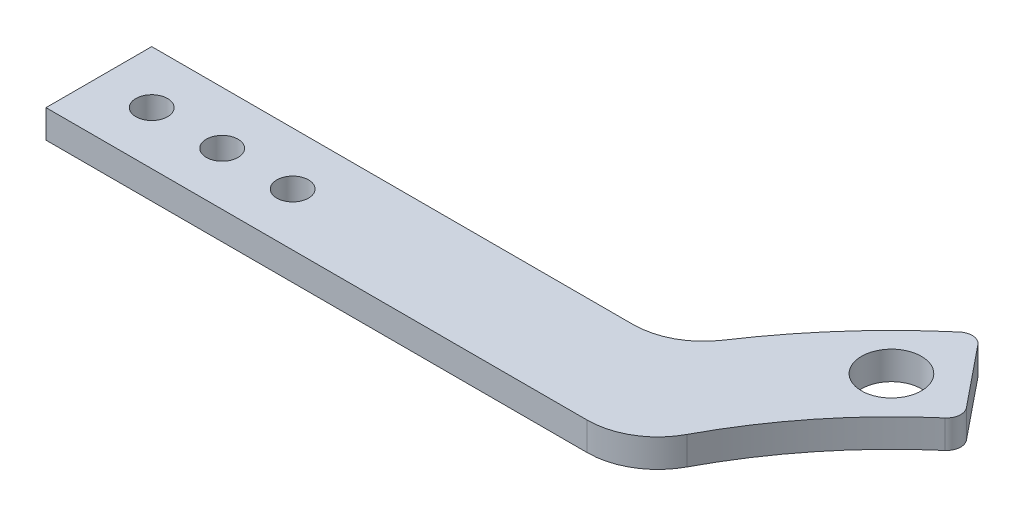
ISO-10303-21;
HEADER;
FILE_DESCRIPTION(('STEP AP214'),'2;1');
FILE_NAME('part.step','',(''),(''),'','','');
FILE_SCHEMA(('AUTOMOTIVE_DESIGN { 1 0 10303 214 1 1 1 1 }'));
ENDSEC;
DATA;
#1=APPLICATION_CONTEXT('core data for automotive mechanical design processes');
#2=APPLICATION_PROTOCOL_DEFINITION('international standard','automotive_design',2000,#1);
#3=PRODUCT_CONTEXT('',#1,'mechanical');
#4=PRODUCT('Part','Part','',(#3));
#5=PRODUCT_RELATED_PRODUCT_CATEGORY('part','',(#4));
#6=PRODUCT_DEFINITION_FORMATION('','',#4);
#7=PRODUCT_DEFINITION_CONTEXT('part definition',#1,'design');
#8=PRODUCT_DEFINITION('design','',#6,#7);
#9=PRODUCT_DEFINITION_SHAPE('','',#8);
#10=(LENGTH_UNIT() NAMED_UNIT(*) SI_UNIT(.MILLI.,.METRE.));
#11=(NAMED_UNIT(*) PLANE_ANGLE_UNIT() SI_UNIT($,.RADIAN.));
#12=(NAMED_UNIT(*) SI_UNIT($,.STERADIAN.) SOLID_ANGLE_UNIT());
#13=UNCERTAINTY_MEASURE_WITH_UNIT(LENGTH_MEASURE(1.E-05),#10,'distance_accuracy_value','');
#14=(GEOMETRIC_REPRESENTATION_CONTEXT(3) GLOBAL_UNCERTAINTY_ASSIGNED_CONTEXT((#13)) GLOBAL_UNIT_ASSIGNED_CONTEXT((#10,
#11,#12)) REPRESENTATION_CONTEXT('',''));
#15=CARTESIAN_POINT('',(0.,0.,0.));
#16=DIRECTION('',(0.,0.,1.));
#17=DIRECTION('',(1.,0.,0.));
#18=AXIS2_PLACEMENT_3D('',#15,#16,#17);
#19=CARTESIAN_POINT('',(-119.959666924148,0.,-35.));
#20=DIRECTION('',(0.,1.,0.));
#21=DIRECTION('',(0.,0.,1.));
#22=AXIS2_PLACEMENT_3D('',#19,#20,#21);
#23=CYLINDRICAL_SURFACE('',#22,2.25000000000001);
#24=CARTESIAN_POINT('',(-119.959666924148,0.,-35.));
#25=DIRECTION('',(0.,1.,0.));
#26=DIRECTION('',(0.,0.,1.));
#27=AXIS2_PLACEMENT_3D('',#24,#25,#26);
#28=CIRCLE('',#27,2.25000000000001);
#29=CARTESIAN_POINT('',(-119.959666924148,0.,-32.75));
#30=VERTEX_POINT('',#29);
#31=EDGE_CURVE('E156',#30,#30,#28,.T.);
#32=ORIENTED_EDGE('',*,*,#31,.F.);
#33=EDGE_LOOP('',(#32));
#34=FACE_BOUND('',#33,.T.);
#35=CARTESIAN_POINT('',(-119.959666924148,4.,-35.));
#36=DIRECTION('',(0.,1.,0.));
#37=DIRECTION('',(0.,0.,1.));
#38=AXIS2_PLACEMENT_3D('',#35,#36,#37);
#39=CIRCLE('',#38,2.25000000000001);
#40=CARTESIAN_POINT('',(-119.959666924148,4.,-32.75));
#41=VERTEX_POINT('',#40);
#42=EDGE_CURVE('E160',#41,#41,#39,.T.);
#43=ORIENTED_EDGE('',*,*,#42,.T.);
#44=EDGE_LOOP('',(#43));
#45=FACE_BOUND('',#44,.T.);
#46=ADVANCED_FACE('F32',(#34,#45),#23,.F.);
#47=CARTESIAN_POINT('',(0.,0.,0.));
#48=DIRECTION('',(-0.777145961456972,0.,0.629320391049836));
#49=DIRECTION('',(0.629320391049836,0.,0.777145961456972));
#50=AXIS2_PLACEMENT_3D('',#47,#48,#49);
#51=PLANE('',#50);
#52=DIRECTION('',(0.629320391049836,0.,0.777145961456972));
#53=VECTOR('',#52,1.);
#54=CARTESIAN_POINT('',(0.,4.,0.));
#55=LINE('',#54,#53);
#56=CARTESIAN_POINT('',(-52.2184259084842,4.,-64.4843856731236));
#57=VERTEX_POINT('',#56);
#58=CARTESIAN_POINT('',(-45.293583660183,4.,-55.9329176712426));
#59=VERTEX_POINT('',#58);
#60=EDGE_CURVE('E138',#57,#59,#55,.T.);
#61=ORIENTED_EDGE('',*,*,#60,.T.);
#62=DIRECTION('',(0.,1.,0.));
#63=VECTOR('',#62,1.);
#64=CARTESIAN_POINT('',(-45.293583660183,0.,-55.9329176712426));
#65=LINE('',#64,#63);
#66=CARTESIAN_POINT('',(-45.293583660183,0.,-55.9329176712426));
#67=VERTEX_POINT('',#66);
#68=EDGE_CURVE('E53',#59,#67,#65,.F.);
#69=ORIENTED_EDGE('',*,*,#68,.T.);
#70=DIRECTION('',(0.629320391049836,0.,0.777145961456972));
#71=VECTOR('',#70,1.);
#72=CARTESIAN_POINT('',(0.,0.,0.));
#73=LINE('',#72,#71);
#74=CARTESIAN_POINT('',(-52.2184259084842,0.,-64.4843856731236));
#75=VERTEX_POINT('',#74);
#76=EDGE_CURVE('E141',#75,#67,#73,.T.);
#77=ORIENTED_EDGE('',*,*,#76,.F.);
#78=DIRECTION('',(0.,-1.,0.));
#79=VECTOR('',#78,1.);
#80=CARTESIAN_POINT('',(-52.2184259084842,0.,-64.4843856731236));
#81=LINE('',#80,#79);
#82=EDGE_CURVE('E189',#75,#57,#81,.F.);
#83=ORIENTED_EDGE('',*,*,#82,.T.);
#84=EDGE_LOOP('',(#61,#69,#77,#83));
#85=FACE_BOUND('',#84,.T.);
#86=ADVANCED_FACE('F211',(#85),#51,.F.);
#87=CARTESIAN_POINT('',(-147.459666924148,4.,-27.5));
#88=DIRECTION('',(0.,0.,-1.));
#89=DIRECTION('',(-1.,0.,0.));
#90=AXIS2_PLACEMENT_3D('',#87,#88,#89);
#91=PLANE('',#90);
#92=DIRECTION('',(1.,0.,0.));
#93=VECTOR('',#92,1.);
#94=CARTESIAN_POINT('',(-147.459666924148,0.,-27.5));
#95=LINE('',#94,#93);
#96=CARTESIAN_POINT('',(-147.459666924148,0.,-27.5));
#97=VERTEX_POINT('',#96);
#98=CARTESIAN_POINT('',(-70.6664701255129,0.,-27.5));
#99=VERTEX_POINT('',#98);
#100=EDGE_CURVE('E227',#97,#99,#95,.T.);
#101=ORIENTED_EDGE('',*,*,#100,.T.);
#102=DIRECTION('',(0.,1.,0.));
#103=VECTOR('',#102,1.);
#104=CARTESIAN_POINT('',(-70.6664701255129,4.,-27.5));
#105=LINE('',#104,#103);
#106=CARTESIAN_POINT('',(-70.6664701255129,4.,-27.5));
#107=VERTEX_POINT('',#106);
#108=EDGE_CURVE('E118',#99,#107,#105,.T.);
#109=ORIENTED_EDGE('',*,*,#108,.T.);
#110=DIRECTION('',(1.,0.,0.));
#111=VECTOR('',#110,1.);
#112=CARTESIAN_POINT('',(-147.459666924148,4.,-27.5));
#113=LINE('',#112,#111);
#114=CARTESIAN_POINT('',(-147.459666924148,4.,-27.5));
#115=VERTEX_POINT('',#114);
#116=EDGE_CURVE('E110',#115,#107,#113,.T.);
#117=ORIENTED_EDGE('',*,*,#116,.F.);
#118=DIRECTION('',(0.,-1.,0.));
#119=VECTOR('',#118,1.);
#120=CARTESIAN_POINT('',(-147.459666924148,4.,-27.5));
#121=LINE('',#120,#119);
#122=EDGE_CURVE('E115',#115,#97,#121,.T.);
#123=ORIENTED_EDGE('',*,*,#122,.T.);
#124=EDGE_LOOP('',(#101,#109,#117,#123));
#125=FACE_BOUND('',#124,.T.);
#126=ADVANCED_FACE('F113',(#125),#91,.F.);
#127=CARTESIAN_POINT('',(0.,4.,0.));
#128=DIRECTION('',(0.,-1.,0.));
#129=DIRECTION('',(0.,0.,-1.));
#130=AXIS2_PLACEMENT_3D('',#127,#128,#129);
#131=CYLINDRICAL_SURFACE('',#130,85.);
#132=CARTESIAN_POINT('',(0.,4.,0.));
#133=DIRECTION('',(0.,1.,0.));
#134=DIRECTION('',(0.,0.,1.));
#135=AXIS2_PLACEMENT_3D('',#132,#133,#134);
#136=CIRCLE('',#135,85.);
#137=CARTESIAN_POINT('',(-55.0684459719138,4.,-64.7492568161089));
#138=VERTEX_POINT('',#137);
#139=CARTESIAN_POINT('',(-70.8411814673482,4.,-46.9736842105263));
#140=VERTEX_POINT('',#139);
#141=EDGE_CURVE('E154',#138,#140,#136,.T.);
#142=ORIENTED_EDGE('',*,*,#141,.F.);
#143=DIRECTION('',(0.,-1.,0.));
#144=VECTOR('',#143,1.);
#145=CARTESIAN_POINT('',(-55.0684459719138,4.,-64.7492568161089));
#146=LINE('',#145,#144);
#147=CARTESIAN_POINT('',(-55.0684459719138,0.,-64.7492568161089));
#148=VERTEX_POINT('',#147);
#149=EDGE_CURVE('E11',#138,#148,#146,.T.);
#150=ORIENTED_EDGE('',*,*,#149,.T.);
#151=CARTESIAN_POINT('',(0.,0.,0.));
#152=DIRECTION('',(0.,1.,0.));
#153=DIRECTION('',(0.,0.,1.));
#154=AXIS2_PLACEMENT_3D('',#151,#152,#153);
#155=CIRCLE('',#154,85.);
#156=CARTESIAN_POINT('',(-70.8411814673482,0.,-46.9736842105263));
#157=VERTEX_POINT('',#156);
#158=EDGE_CURVE('E151',#148,#157,#155,.T.);
#159=ORIENTED_EDGE('',*,*,#158,.T.);
#160=DIRECTION('',(0.,-1.,0.));
#161=VECTOR('',#160,1.);
#162=CARTESIAN_POINT('',(-70.8411814673482,4.,-46.9736842105263));
#163=LINE('',#162,#161);
#164=EDGE_CURVE('E174',#157,#140,#163,.F.);
#165=ORIENTED_EDGE('',*,*,#164,.T.);
#166=EDGE_LOOP('',(#142,#150,#159,#165));
#167=FACE_BOUND('',#166,.T.);
#168=ADVANCED_FACE('F215',(#167),#131,.T.);
#169=CARTESIAN_POINT('',(0.,4.,0.));
#170=DIRECTION('',(0.,1.,0.));
#171=DIRECTION('',(0.,0.,1.));
#172=AXIS2_PLACEMENT_3D('',#169,#170,#171);
#173=PLANE('',#172);
#174=CARTESIAN_POINT('',(-129.959666924148,4.,-35.));
#175=DIRECTION('',(0.,1.,0.));
#176=DIRECTION('',(0.,0.,1.));
#177=AXIS2_PLACEMENT_3D('',#174,#175,#176);
#178=CIRCLE('',#177,2.25000000000001);
#179=CARTESIAN_POINT('',(-129.959666924148,4.,-32.75));
#180=VERTEX_POINT('',#179);
#181=EDGE_CURVE('E282',#180,#180,#178,.T.);
#182=ORIENTED_EDGE('',*,*,#181,.F.);
#183=EDGE_LOOP('',(#182));
#184=FACE_BOUND('',#183,.T.);
#185=CARTESIAN_POINT('',(-139.959666924148,4.,-35.));
#186=DIRECTION('',(0.,1.,0.));
#187=DIRECTION('',(0.,0.,1.));
#188=AXIS2_PLACEMENT_3D('',#185,#186,#187);
#189=CIRCLE('',#188,2.25000000000001);
#190=CARTESIAN_POINT('',(-139.959666924148,4.,-32.75));
#191=VERTEX_POINT('',#190);
#192=EDGE_CURVE('E280',#191,#191,#189,.T.);
#193=ORIENTED_EDGE('',*,*,#192,.F.);
#194=EDGE_LOOP('',(#193));
#195=FACE_BOUND('',#194,.T.);
#196=CARTESIAN_POINT('',(0.,4.,0.));
#197=DIRECTION('',(0.,1.,0.));
#198=DIRECTION('',(0.,0.,1.));
#199=AXIS2_PLACEMENT_3D('',#196,#197,#198);
#200=CIRCLE('',#199,70.);
#201=CARTESIAN_POINT('',(-45.5465457057887,4.,-53.1555469755557));
#202=VERTEX_POINT('',#201);
#203=CARTESIAN_POINT('',(-61.8331613598238,4.,-32.8125));
#204=VERTEX_POINT('',#203);
#205=EDGE_CURVE('E206',#202,#204,#200,.T.);
#206=ORIENTED_EDGE('',*,*,#205,.F.);
#207=CARTESIAN_POINT('',(-46.8478755830969,4.,-54.674276889143));
#208=DIRECTION('',(0.,1.,0.));
#209=DIRECTION('',(0.,0.,1.));
#210=AXIS2_PLACEMENT_3D('',#207,#208,#209);
#211=CIRCLE('',#210,2.);
#212=EDGE_CURVE('E187',#202,#59,#211,.T.);
#213=ORIENTED_EDGE('',*,*,#212,.T.);
#214=ORIENTED_EDGE('',*,*,#60,.F.);
#215=CARTESIAN_POINT('',(-53.7727178313981,4.,-63.225744891024));
#216=DIRECTION('',(0.,1.,0.));
#217=DIRECTION('',(0.,0.,1.));
#218=AXIS2_PLACEMENT_3D('',#215,#216,#217);
#219=CIRCLE('',#218,2.);
#220=EDGE_CURVE('E185',#57,#138,#219,.T.);
#221=ORIENTED_EDGE('',*,*,#220,.T.);
#222=ORIENTED_EDGE('',*,*,#141,.T.);
#223=CARTESIAN_POINT('',(-79.1754381105656,4.,-52.5));
#224=DIRECTION('',(0.,1.,0.));
#225=DIRECTION('',(0.,0.,1.));
#226=AXIS2_PLACEMENT_3D('',#223,#224,#225);
#227=CIRCLE('',#226,10.);
#228=CARTESIAN_POINT('',(-79.1754381105656,4.,-42.5));
#229=VERTEX_POINT('',#228);
#230=EDGE_CURVE('E180',#140,#229,#227,.F.);
#231=ORIENTED_EDGE('',*,*,#230,.T.);
#232=DIRECTION('',(-1.,0.,0.));
#233=VECTOR('',#232,1.);
#234=CARTESIAN_POINT('',(-147.459666924148,4.,-42.5));
#235=LINE('',#234,#233);
#236=CARTESIAN_POINT('',(-147.459666924148,4.,-42.5));
#237=VERTEX_POINT('',#236);
#238=EDGE_CURVE('E122',#229,#237,#235,.T.);
#239=ORIENTED_EDGE('',*,*,#238,.T.);
#240=DIRECTION('',(0.,0.,1.));
#241=VECTOR('',#240,1.);
#242=CARTESIAN_POINT('',(-147.459666924148,4.,-42.5));
#243=LINE('',#242,#241);
#244=EDGE_CURVE('E123',#237,#115,#243,.T.);
#245=ORIENTED_EDGE('',*,*,#244,.T.);
#246=ORIENTED_EDGE('',*,*,#116,.T.);
#247=CARTESIAN_POINT('',(-70.6664701255129,4.,-37.5));
#248=DIRECTION('',(0.,1.,0.));
#249=DIRECTION('',(0.,0.,1.));
#250=AXIS2_PLACEMENT_3D('',#247,#248,#249);
#251=CIRCLE('',#250,10.);
#252=EDGE_CURVE('E169',#107,#204,#251,.T.);
#253=ORIENTED_EDGE('',*,*,#252,.T.);
#254=EDGE_LOOP('',(#206,#213,#214,#221,#222,#231,#239,#245,#246,#253));
#255=FACE_BOUND('',#254,.T.);
#256=CARTESIAN_POINT('',(-54.8007755419573,4.,-54.8007755419575));
#257=DIRECTION('',(0.,1.,0.));
#258=DIRECTION('',(0.,0.,1.));
#259=AXIS2_PLACEMENT_3D('',#256,#257,#258);
#260=CIRCLE('',#259,4.25000000000001);
#261=CARTESIAN_POINT('',(-54.8007755419573,4.,-50.5507755419575));
#262=VERTEX_POINT('',#261);
#263=EDGE_CURVE('E146',#262,#262,#260,.T.);
#264=ORIENTED_EDGE('',*,*,#263,.F.);
#265=EDGE_LOOP('',(#264));
#266=FACE_BOUND('',#265,.T.);
#267=ORIENTED_EDGE('',*,*,#42,.F.);
#268=EDGE_LOOP('',(#267));
#269=FACE_BOUND('',#268,.T.);
#270=ADVANCED_FACE('F127',(#184,#195,#255,#266,#269),#173,.T.);
#271=CARTESIAN_POINT('',(0.,0.,0.));
#272=DIRECTION('',(0.,1.,0.));
#273=DIRECTION('',(0.,0.,1.));
#274=AXIS2_PLACEMENT_3D('',#271,#272,#273);
#275=PLANE('',#274);
#276=CARTESIAN_POINT('',(-129.959666924148,0.,-35.));
#277=DIRECTION('',(0.,1.,0.));
#278=DIRECTION('',(0.,0.,1.));
#279=AXIS2_PLACEMENT_3D('',#276,#277,#278);
#280=CIRCLE('',#279,2.25000000000001);
#281=CARTESIAN_POINT('',(-129.959666924148,0.,-32.75));
#282=VERTEX_POINT('',#281);
#283=EDGE_CURVE('E286',#282,#282,#280,.T.);
#284=ORIENTED_EDGE('',*,*,#283,.T.);
#285=EDGE_LOOP('',(#284));
#286=FACE_BOUND('',#285,.T.);
#287=CARTESIAN_POINT('',(-139.959666924148,0.,-35.));
#288=DIRECTION('',(0.,1.,0.));
#289=DIRECTION('',(0.,0.,1.));
#290=AXIS2_PLACEMENT_3D('',#287,#288,#289);
#291=CIRCLE('',#290,2.25000000000001);
#292=CARTESIAN_POINT('',(-139.959666924148,0.,-32.75));
#293=VERTEX_POINT('',#292);
#294=EDGE_CURVE('E207',#293,#293,#291,.T.);
#295=ORIENTED_EDGE('',*,*,#294,.T.);
#296=EDGE_LOOP('',(#295));
#297=FACE_BOUND('',#296,.T.);
#298=ORIENTED_EDGE('',*,*,#76,.T.);
#299=CARTESIAN_POINT('',(-46.8478755830969,0.,-54.674276889143));
#300=DIRECTION('',(0.,1.,0.));
#301=DIRECTION('',(0.,0.,1.));
#302=AXIS2_PLACEMENT_3D('',#299,#300,#301);
#303=CIRCLE('',#302,2.);
#304=CARTESIAN_POINT('',(-45.5465457057887,0.,-53.1555469755557));
#305=VERTEX_POINT('',#304);
#306=EDGE_CURVE('E40',#67,#305,#303,.F.);
#307=ORIENTED_EDGE('',*,*,#306,.T.);
#308=CARTESIAN_POINT('',(0.,0.,0.));
#309=DIRECTION('',(0.,1.,0.));
#310=DIRECTION('',(0.,0.,1.));
#311=AXIS2_PLACEMENT_3D('',#308,#309,#310);
#312=CIRCLE('',#311,70.);
#313=CARTESIAN_POINT('',(-61.8331613598238,0.,-32.8125));
#314=VERTEX_POINT('',#313);
#315=EDGE_CURVE('E199',#305,#314,#312,.T.);
#316=ORIENTED_EDGE('',*,*,#315,.T.);
#317=CARTESIAN_POINT('',(-70.6664701255129,0.,-37.5));
#318=DIRECTION('',(0.,1.,0.));
#319=DIRECTION('',(0.,0.,1.));
#320=AXIS2_PLACEMENT_3D('',#317,#318,#319);
#321=CIRCLE('',#320,10.);
#322=EDGE_CURVE('E166',#314,#99,#321,.F.);
#323=ORIENTED_EDGE('',*,*,#322,.T.);
#324=ORIENTED_EDGE('',*,*,#100,.F.);
#325=DIRECTION('',(0.,0.,1.));
#326=VECTOR('',#325,1.);
#327=CARTESIAN_POINT('',(-147.459666924148,0.,-42.5));
#328=LINE('',#327,#326);
#329=CARTESIAN_POINT('',(-147.459666924148,0.,-42.5));
#330=VERTEX_POINT('',#329);
#331=EDGE_CURVE('E137',#330,#97,#328,.T.);
#332=ORIENTED_EDGE('',*,*,#331,.F.);
#333=DIRECTION('',(-1.,0.,0.));
#334=VECTOR('',#333,1.);
#335=CARTESIAN_POINT('',(-147.459666924148,0.,-42.5));
#336=LINE('',#335,#334);
#337=CARTESIAN_POINT('',(-79.1754381105656,0.,-42.5));
#338=VERTEX_POINT('',#337);
#339=EDGE_CURVE('E133',#338,#330,#336,.T.);
#340=ORIENTED_EDGE('',*,*,#339,.F.);
#341=CARTESIAN_POINT('',(-79.1754381105656,0.,-52.5));
#342=DIRECTION('',(0.,1.,0.));
#343=DIRECTION('',(0.,0.,1.));
#344=AXIS2_PLACEMENT_3D('',#341,#342,#343);
#345=CIRCLE('',#344,10.);
#346=EDGE_CURVE('E177',#338,#157,#345,.T.);
#347=ORIENTED_EDGE('',*,*,#346,.T.);
#348=ORIENTED_EDGE('',*,*,#158,.F.);
#349=CARTESIAN_POINT('',(-53.7727178313981,0.,-63.225744891024));
#350=DIRECTION('',(0.,1.,0.));
#351=DIRECTION('',(0.,0.,1.));
#352=AXIS2_PLACEMENT_3D('',#349,#350,#351);
#353=CIRCLE('',#352,2.);
#354=EDGE_CURVE('E193',#148,#75,#353,.F.);
#355=ORIENTED_EDGE('',*,*,#354,.T.);
#356=EDGE_LOOP('',(#298,#307,#316,#323,#324,#332,#340,#347,#348,#355));
#357=FACE_BOUND('',#356,.T.);
#358=CARTESIAN_POINT('',(-54.8007755419573,0.,-54.8007755419575));
#359=DIRECTION('',(0.,1.,0.));
#360=DIRECTION('',(0.,0.,1.));
#361=AXIS2_PLACEMENT_3D('',#358,#359,#360);
#362=CIRCLE('',#361,4.25000000000001);
#363=CARTESIAN_POINT('',(-54.8007755419573,0.,-50.5507755419575));
#364=VERTEX_POINT('',#363);
#365=EDGE_CURVE('E148',#364,#364,#362,.T.);
#366=ORIENTED_EDGE('',*,*,#365,.T.);
#367=EDGE_LOOP('',(#366));
#368=FACE_BOUND('',#367,.T.);
#369=ORIENTED_EDGE('',*,*,#31,.T.);
#370=EDGE_LOOP('',(#369));
#371=FACE_BOUND('',#370,.T.);
#372=ADVANCED_FACE('F197',(#286,#297,#357,#368,#371),#275,.F.);
#373=CARTESIAN_POINT('',(-54.8007755419573,0.,-54.8007755419575));
#374=DIRECTION('',(0.,1.,0.));
#375=DIRECTION('',(0.,0.,1.));
#376=AXIS2_PLACEMENT_3D('',#373,#374,#375);
#377=CYLINDRICAL_SURFACE('',#376,4.25000000000001);
#378=ORIENTED_EDGE('',*,*,#365,.F.);
#379=EDGE_LOOP('',(#378));
#380=FACE_BOUND('',#379,.T.);
#381=ORIENTED_EDGE('',*,*,#263,.T.);
#382=EDGE_LOOP('',(#381));
#383=FACE_BOUND('',#382,.T.);
#384=ADVANCED_FACE('F255',(#380,#383),#377,.F.);
#385=CARTESIAN_POINT('',(-147.459666924148,4.,-42.5));
#386=DIRECTION('',(0.,0.,1.));
#387=DIRECTION('',(1.,0.,0.));
#388=AXIS2_PLACEMENT_3D('',#385,#386,#387);
#389=PLANE('',#388);
#390=ORIENTED_EDGE('',*,*,#238,.F.);
#391=DIRECTION('',(0.,1.,0.));
#392=VECTOR('',#391,1.);
#393=CARTESIAN_POINT('',(-79.1754381105656,0.,-42.5));
#394=LINE('',#393,#392);
#395=EDGE_CURVE('E171',#229,#338,#394,.F.);
#396=ORIENTED_EDGE('',*,*,#395,.T.);
#397=ORIENTED_EDGE('',*,*,#339,.T.);
#398=DIRECTION('',(0.,-1.,0.));
#399=VECTOR('',#398,1.);
#400=CARTESIAN_POINT('',(-147.459666924148,4.,-42.5));
#401=LINE('',#400,#399);
#402=EDGE_CURVE('E139',#237,#330,#401,.T.);
#403=ORIENTED_EDGE('',*,*,#402,.F.);
#404=EDGE_LOOP('',(#390,#396,#397,#403));
#405=FACE_BOUND('',#404,.T.);
#406=ADVANCED_FACE('F222',(#405),#389,.F.);
#407=CARTESIAN_POINT('',(-147.459666924148,4.,-42.5));
#408=DIRECTION('',(1.,0.,0.));
#409=DIRECTION('',(0.,0.,-1.));
#410=AXIS2_PLACEMENT_3D('',#407,#408,#409);
#411=PLANE('',#410);
#412=ORIENTED_EDGE('',*,*,#331,.T.);
#413=ORIENTED_EDGE('',*,*,#122,.F.);
#414=ORIENTED_EDGE('',*,*,#244,.F.);
#415=ORIENTED_EDGE('',*,*,#402,.T.);
#416=EDGE_LOOP('',(#412,#413,#414,#415));
#417=FACE_BOUND('',#416,.T.);
#418=ADVANCED_FACE('F135',(#417),#411,.F.);
#419=CARTESIAN_POINT('',(0.,4.,0.));
#420=DIRECTION('',(0.,-1.,0.));
#421=DIRECTION('',(0.,0.,-1.));
#422=AXIS2_PLACEMENT_3D('',#419,#420,#421);
#423=CYLINDRICAL_SURFACE('',#422,70.);
#424=ORIENTED_EDGE('',*,*,#315,.F.);
#425=DIRECTION('',(0.,-1.,0.));
#426=VECTOR('',#425,1.);
#427=CARTESIAN_POINT('',(-45.5465457057887,4.,-53.1555469755557));
#428=LINE('',#427,#426);
#429=EDGE_CURVE('E182',#305,#202,#428,.F.);
#430=ORIENTED_EDGE('',*,*,#429,.T.);
#431=ORIENTED_EDGE('',*,*,#205,.T.);
#432=DIRECTION('',(0.,-1.,0.));
#433=VECTOR('',#432,1.);
#434=CARTESIAN_POINT('',(-61.8331613598238,4.,-32.8125));
#435=LINE('',#434,#433);
#436=EDGE_CURVE('E163',#204,#314,#435,.T.);
#437=ORIENTED_EDGE('',*,*,#436,.T.);
#438=EDGE_LOOP('',(#424,#430,#431,#437));
#439=FACE_BOUND('',#438,.T.);
#440=ADVANCED_FACE('F204',(#439),#423,.F.);
#441=CARTESIAN_POINT('',(-139.959666924148,0.,-35.));
#442=DIRECTION('',(0.,1.,0.));
#443=DIRECTION('',(0.,0.,1.));
#444=AXIS2_PLACEMENT_3D('',#441,#442,#443);
#445=CYLINDRICAL_SURFACE('',#444,2.25000000000001);
#446=ORIENTED_EDGE('',*,*,#294,.F.);
#447=EDGE_LOOP('',(#446));
#448=FACE_BOUND('',#447,.T.);
#449=ORIENTED_EDGE('',*,*,#192,.T.);
#450=EDGE_LOOP('',(#449));
#451=FACE_BOUND('',#450,.T.);
#452=ADVANCED_FACE('F238',(#448,#451),#445,.F.);
#453=CARTESIAN_POINT('',(-129.959666924148,0.,-35.));
#454=DIRECTION('',(0.,1.,0.));
#455=DIRECTION('',(0.,0.,1.));
#456=AXIS2_PLACEMENT_3D('',#453,#454,#455);
#457=CYLINDRICAL_SURFACE('',#456,2.25000000000001);
#458=ORIENTED_EDGE('',*,*,#283,.F.);
#459=EDGE_LOOP('',(#458));
#460=FACE_BOUND('',#459,.T.);
#461=ORIENTED_EDGE('',*,*,#181,.T.);
#462=EDGE_LOOP('',(#461));
#463=FACE_BOUND('',#462,.T.);
#464=ADVANCED_FACE('F231',(#460,#463),#457,.F.);
#465=CARTESIAN_POINT('',(-70.6664701255129,4.,-37.5));
#466=DIRECTION('',(0.,-1.,0.));
#467=DIRECTION('',(0.,0.,-1.));
#468=AXIS2_PLACEMENT_3D('',#465,#466,#467);
#469=CYLINDRICAL_SURFACE('',#468,10.);
#470=ORIENTED_EDGE('',*,*,#252,.F.);
#471=ORIENTED_EDGE('',*,*,#108,.F.);
#472=ORIENTED_EDGE('',*,*,#322,.F.);
#473=ORIENTED_EDGE('',*,*,#436,.F.);
#474=EDGE_LOOP('',(#470,#471,#472,#473));
#475=FACE_BOUND('',#474,.T.);
#476=ADVANCED_FACE('F229',(#475),#469,.T.);
#477=CARTESIAN_POINT('',(-79.1754381105656,4.,-52.5));
#478=DIRECTION('',(0.,-1.,0.));
#479=DIRECTION('',(0.,0.,-1.));
#480=AXIS2_PLACEMENT_3D('',#477,#478,#479);
#481=CYLINDRICAL_SURFACE('',#480,10.);
#482=ORIENTED_EDGE('',*,*,#230,.F.);
#483=ORIENTED_EDGE('',*,*,#164,.F.);
#484=ORIENTED_EDGE('',*,*,#346,.F.);
#485=ORIENTED_EDGE('',*,*,#395,.F.);
#486=EDGE_LOOP('',(#482,#483,#484,#485));
#487=FACE_BOUND('',#486,.T.);
#488=ADVANCED_FACE('F220',(#487),#481,.F.);
#489=CARTESIAN_POINT('',(-46.8478755830969,4.,-54.674276889143));
#490=DIRECTION('',(0.,-1.,0.));
#491=DIRECTION('',(0.,0.,-1.));
#492=AXIS2_PLACEMENT_3D('',#489,#490,#491);
#493=CYLINDRICAL_SURFACE('',#492,2.);
#494=ORIENTED_EDGE('',*,*,#306,.F.);
#495=ORIENTED_EDGE('',*,*,#68,.F.);
#496=ORIENTED_EDGE('',*,*,#212,.F.);
#497=ORIENTED_EDGE('',*,*,#429,.F.);
#498=EDGE_LOOP('',(#494,#495,#496,#497));
#499=FACE_BOUND('',#498,.T.);
#500=ADVANCED_FACE('F209',(#499),#493,.T.);
#501=CARTESIAN_POINT('',(-53.7727178313981,4.,-63.225744891024));
#502=DIRECTION('',(0.,-1.,0.));
#503=DIRECTION('',(0.,0.,-1.));
#504=AXIS2_PLACEMENT_3D('',#501,#502,#503);
#505=CYLINDRICAL_SURFACE('',#504,2.);
#506=ORIENTED_EDGE('',*,*,#354,.F.);
#507=ORIENTED_EDGE('',*,*,#149,.F.);
#508=ORIENTED_EDGE('',*,*,#220,.F.);
#509=ORIENTED_EDGE('',*,*,#82,.F.);
#510=EDGE_LOOP('',(#506,#507,#508,#509));
#511=FACE_BOUND('',#510,.T.);
#512=ADVANCED_FACE('F34',(#511),#505,.T.);
#513=CLOSED_SHELL('',(#46,#86,#126,#168,#270,#372,#384,#406,#418,#440,#452,#464,#476,#488,#500,#512));
#514=MANIFOLD_SOLID_BREP('B2',#513);
#515=ADVANCED_BREP_SHAPE_REPRESENTATION('',(#18,#514),#14);
#516=SHAPE_DEFINITION_REPRESENTATION(#9,#515);
ENDSEC;
END-ISO-10303-21;
